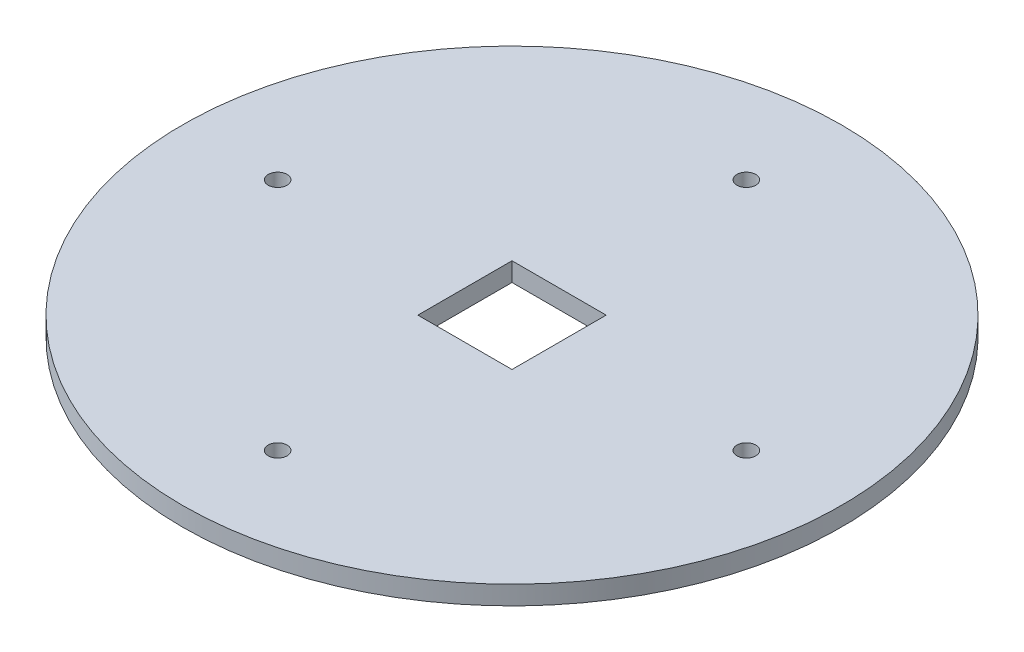
ISO-10303-21;
HEADER;
FILE_DESCRIPTION(('STEP AP214'),'2;1');
FILE_NAME('part.step','',(''),(''),'','','');
FILE_SCHEMA(('AUTOMOTIVE_DESIGN { 1 0 10303 214 1 1 1 1 }'));
ENDSEC;
DATA;
#1=APPLICATION_CONTEXT('core data for automotive mechanical design processes');
#2=APPLICATION_PROTOCOL_DEFINITION('international standard','automotive_design',2000,#1);
#3=PRODUCT_CONTEXT('',#1,'mechanical');
#4=PRODUCT('Part','Part','',(#3));
#5=PRODUCT_RELATED_PRODUCT_CATEGORY('part','',(#4));
#6=PRODUCT_DEFINITION_FORMATION('','',#4);
#7=PRODUCT_DEFINITION_CONTEXT('part definition',#1,'design');
#8=PRODUCT_DEFINITION('design','',#6,#7);
#9=PRODUCT_DEFINITION_SHAPE('','',#8);
#10=(LENGTH_UNIT() NAMED_UNIT(*) SI_UNIT(.MILLI.,.METRE.));
#11=(NAMED_UNIT(*) PLANE_ANGLE_UNIT() SI_UNIT($,.RADIAN.));
#12=(NAMED_UNIT(*) SI_UNIT($,.STERADIAN.) SOLID_ANGLE_UNIT());
#13=UNCERTAINTY_MEASURE_WITH_UNIT(LENGTH_MEASURE(1.E-05),#10,'distance_accuracy_value','');
#14=(GEOMETRIC_REPRESENTATION_CONTEXT(3) GLOBAL_UNCERTAINTY_ASSIGNED_CONTEXT((#13)) GLOBAL_UNIT_ASSIGNED_CONTEXT((#10,
#11,#12)) REPRESENTATION_CONTEXT('',''));
#15=CARTESIAN_POINT('',(0.,0.,0.));
#16=DIRECTION('',(0.,0.,1.));
#17=DIRECTION('',(1.,0.,0.));
#18=AXIS2_PLACEMENT_3D('',#15,#16,#17);
#19=CARTESIAN_POINT('',(0.,2.,0.));
#20=DIRECTION('',(0.,1.,0.));
#21=DIRECTION('',(0.,0.,1.));
#22=AXIS2_PLACEMENT_3D('',#19,#20,#21);
#23=PLANE('',#22);
#24=CARTESIAN_POINT('',(0.,2.,24.89));
#25=DIRECTION('',(0.,1.,0.));
#26=DIRECTION('',(0.,0.,1.));
#27=AXIS2_PLACEMENT_3D('',#24,#25,#26);
#28=CIRCLE('',#27,1.);
#29=CARTESIAN_POINT('',(0.,2.,25.89));
#30=VERTEX_POINT('',#29);
#31=EDGE_CURVE('E140',#30,#30,#28,.T.);
#32=ORIENTED_EDGE('',*,*,#31,.F.);
#33=EDGE_LOOP('',(#32));
#34=FACE_BOUND('',#33,.T.);
#35=DIRECTION('',(-1.,0.,0.));
#36=VECTOR('',#35,1.);
#37=CARTESIAN_POINT('',(-5.,2.,-5.));
#38=LINE('',#37,#36);
#39=CARTESIAN_POINT('',(5.,2.,-5.));
#40=VERTEX_POINT('',#39);
#41=CARTESIAN_POINT('',(-5.,2.,-5.));
#42=VERTEX_POINT('',#41);
#43=EDGE_CURVE('E82',#40,#42,#38,.T.);
#44=ORIENTED_EDGE('',*,*,#43,.F.);
#45=DIRECTION('',(0.,0.,-1.));
#46=VECTOR('',#45,1.);
#47=CARTESIAN_POINT('',(5.,2.,-5.));
#48=LINE('',#47,#46);
#49=CARTESIAN_POINT('',(5.,2.,5.));
#50=VERTEX_POINT('',#49);
#51=EDGE_CURVE('E74',#50,#40,#48,.T.);
#52=ORIENTED_EDGE('',*,*,#51,.F.);
#53=DIRECTION('',(1.,0.,0.));
#54=VECTOR('',#53,1.);
#55=CARTESIAN_POINT('',(-5.,2.,5.));
#56=LINE('',#55,#54);
#57=CARTESIAN_POINT('',(-5.,2.,5.));
#58=VERTEX_POINT('',#57);
#59=EDGE_CURVE('E97',#58,#50,#56,.T.);
#60=ORIENTED_EDGE('',*,*,#59,.F.);
#61=DIRECTION('',(0.,0.,1.));
#62=VECTOR('',#61,1.);
#63=CARTESIAN_POINT('',(-5.,2.,-5.));
#64=LINE('',#63,#62);
#65=EDGE_CURVE('E95',#42,#58,#64,.T.);
#66=ORIENTED_EDGE('',*,*,#65,.F.);
#67=EDGE_LOOP('',(#44,#52,#60,#66));
#68=FACE_BOUND('',#67,.T.);
#69=CARTESIAN_POINT('',(0.,2.,-24.89));
#70=DIRECTION('',(0.,1.,0.));
#71=DIRECTION('',(0.,0.,1.));
#72=AXIS2_PLACEMENT_3D('',#69,#70,#71);
#73=CIRCLE('',#72,1.);
#74=CARTESIAN_POINT('',(0.,2.,-23.89));
#75=VERTEX_POINT('',#74);
#76=EDGE_CURVE('E113',#75,#75,#73,.T.);
#77=ORIENTED_EDGE('',*,*,#76,.F.);
#78=EDGE_LOOP('',(#77));
#79=FACE_BOUND('',#78,.T.);
#80=CARTESIAN_POINT('',(0.,2.,0.));
#81=DIRECTION('',(0.,1.,0.));
#82=DIRECTION('',(0.,0.,1.));
#83=AXIS2_PLACEMENT_3D('',#80,#81,#82);
#84=CIRCLE('',#83,35.);
#85=CARTESIAN_POINT('',(0.,2.,35.));
#86=VERTEX_POINT('',#85);
#87=EDGE_CURVE('E11',#86,#86,#84,.T.);
#88=ORIENTED_EDGE('',*,*,#87,.T.);
#89=EDGE_LOOP('',(#88));
#90=FACE_BOUND('',#89,.T.);
#91=CARTESIAN_POINT('',(24.89,2.,0.));
#92=DIRECTION('',(0.,1.,0.));
#93=DIRECTION('',(0.,0.,1.));
#94=AXIS2_PLACEMENT_3D('',#91,#92,#93);
#95=CIRCLE('',#94,0.999999999999994);
#96=CARTESIAN_POINT('',(24.89,2.,0.999999999999992));
#97=VERTEX_POINT('',#96);
#98=EDGE_CURVE('E103',#97,#97,#95,.T.);
#99=ORIENTED_EDGE('',*,*,#98,.F.);
#100=EDGE_LOOP('',(#99));
#101=FACE_BOUND('',#100,.T.);
#102=CARTESIAN_POINT('',(-24.89,2.,0.));
#103=DIRECTION('',(0.,1.,0.));
#104=DIRECTION('',(0.,0.,1.));
#105=AXIS2_PLACEMENT_3D('',#102,#103,#104);
#106=CIRCLE('',#105,1.);
#107=CARTESIAN_POINT('',(-24.89,2.,1.00000000000001));
#108=VERTEX_POINT('',#107);
#109=EDGE_CURVE('E147',#108,#108,#106,.T.);
#110=ORIENTED_EDGE('',*,*,#109,.F.);
#111=EDGE_LOOP('',(#110));
#112=FACE_BOUND('',#111,.T.);
#113=ADVANCED_FACE('F33',(#34,#68,#79,#90,#101,#112),#23,.T.);
#114=CARTESIAN_POINT('',(0.,0.,0.));
#115=DIRECTION('',(0.,1.,0.));
#116=DIRECTION('',(0.,0.,1.));
#117=AXIS2_PLACEMENT_3D('',#114,#115,#116);
#118=PLANE('',#117);
#119=CARTESIAN_POINT('',(0.,0.,-24.89));
#120=DIRECTION('',(0.,1.,0.));
#121=DIRECTION('',(0.,0.,1.));
#122=AXIS2_PLACEMENT_3D('',#119,#120,#121);
#123=CIRCLE('',#122,1.);
#124=CARTESIAN_POINT('',(0.,0.,-23.89));
#125=VERTEX_POINT('',#124);
#126=EDGE_CURVE('E90',#125,#125,#123,.T.);
#127=ORIENTED_EDGE('',*,*,#126,.T.);
#128=EDGE_LOOP('',(#127));
#129=FACE_BOUND('',#128,.T.);
#130=CARTESIAN_POINT('',(0.,0.,0.));
#131=DIRECTION('',(0.,1.,0.));
#132=DIRECTION('',(0.,0.,1.));
#133=AXIS2_PLACEMENT_3D('',#130,#131,#132);
#134=CIRCLE('',#133,35.);
#135=CARTESIAN_POINT('',(0.,0.,35.));
#136=VERTEX_POINT('',#135);
#137=EDGE_CURVE('E37',#136,#136,#134,.T.);
#138=ORIENTED_EDGE('',*,*,#137,.F.);
#139=EDGE_LOOP('',(#138));
#140=FACE_BOUND('',#139,.T.);
#141=DIRECTION('',(0.,0.,-1.));
#142=VECTOR('',#141,1.);
#143=CARTESIAN_POINT('',(5.,0.,-5.));
#144=LINE('',#143,#142);
#145=CARTESIAN_POINT('',(5.,0.,5.));
#146=VERTEX_POINT('',#145);
#147=CARTESIAN_POINT('',(5.,0.,-5.));
#148=VERTEX_POINT('',#147);
#149=EDGE_CURVE('E56',#146,#148,#144,.T.);
#150=ORIENTED_EDGE('',*,*,#149,.T.);
#151=DIRECTION('',(-1.,0.,0.));
#152=VECTOR('',#151,1.);
#153=CARTESIAN_POINT('',(-5.,0.,-5.));
#154=LINE('',#153,#152);
#155=CARTESIAN_POINT('',(-5.,0.,-5.));
#156=VERTEX_POINT('',#155);
#157=EDGE_CURVE('E89',#148,#156,#154,.T.);
#158=ORIENTED_EDGE('',*,*,#157,.T.);
#159=DIRECTION('',(0.,0.,1.));
#160=VECTOR('',#159,1.);
#161=CARTESIAN_POINT('',(-5.,0.,-5.));
#162=LINE('',#161,#160);
#163=CARTESIAN_POINT('',(-5.,0.,5.));
#164=VERTEX_POINT('',#163);
#165=EDGE_CURVE('E105',#156,#164,#162,.T.);
#166=ORIENTED_EDGE('',*,*,#165,.T.);
#167=DIRECTION('',(1.,0.,0.));
#168=VECTOR('',#167,1.);
#169=CARTESIAN_POINT('',(-5.,0.,5.));
#170=LINE('',#169,#168);
#171=EDGE_CURVE('E83',#164,#146,#170,.T.);
#172=ORIENTED_EDGE('',*,*,#171,.T.);
#173=EDGE_LOOP('',(#150,#158,#166,#172));
#174=FACE_BOUND('',#173,.T.);
#175=CARTESIAN_POINT('',(24.89,0.,0.));
#176=DIRECTION('',(0.,1.,0.));
#177=DIRECTION('',(0.,0.,1.));
#178=AXIS2_PLACEMENT_3D('',#175,#176,#177);
#179=CIRCLE('',#178,0.999999999999994);
#180=CARTESIAN_POINT('',(24.89,0.,0.999999999999992));
#181=VERTEX_POINT('',#180);
#182=EDGE_CURVE('E142',#181,#181,#179,.T.);
#183=ORIENTED_EDGE('',*,*,#182,.T.);
#184=EDGE_LOOP('',(#183));
#185=FACE_BOUND('',#184,.T.);
#186=CARTESIAN_POINT('',(0.,0.,24.89));
#187=DIRECTION('',(0.,1.,0.));
#188=DIRECTION('',(0.,0.,1.));
#189=AXIS2_PLACEMENT_3D('',#186,#187,#188);
#190=CIRCLE('',#189,1.);
#191=CARTESIAN_POINT('',(0.,0.,25.89));
#192=VERTEX_POINT('',#191);
#193=EDGE_CURVE('E143',#192,#192,#190,.T.);
#194=ORIENTED_EDGE('',*,*,#193,.T.);
#195=EDGE_LOOP('',(#194));
#196=FACE_BOUND('',#195,.T.);
#197=CARTESIAN_POINT('',(-24.89,0.,0.));
#198=DIRECTION('',(0.,1.,0.));
#199=DIRECTION('',(0.,0.,1.));
#200=AXIS2_PLACEMENT_3D('',#197,#198,#199);
#201=CIRCLE('',#200,1.);
#202=CARTESIAN_POINT('',(-24.89,0.,1.00000000000001));
#203=VERTEX_POINT('',#202);
#204=EDGE_CURVE('E150',#203,#203,#201,.T.);
#205=ORIENTED_EDGE('',*,*,#204,.T.);
#206=EDGE_LOOP('',(#205));
#207=FACE_BOUND('',#206,.T.);
#208=ADVANCED_FACE('F119',(#129,#140,#174,#185,#196,#207),#118,.F.);
#209=CARTESIAN_POINT('',(0.,2.,0.));
#210=DIRECTION('',(0.,-1.,0.));
#211=DIRECTION('',(0.,0.,-1.));
#212=AXIS2_PLACEMENT_3D('',#209,#210,#211);
#213=CYLINDRICAL_SURFACE('',#212,35.);
#214=ORIENTED_EDGE('',*,*,#87,.F.);
#215=EDGE_LOOP('',(#214));
#216=FACE_BOUND('',#215,.T.);
#217=ORIENTED_EDGE('',*,*,#137,.T.);
#218=EDGE_LOOP('',(#217));
#219=FACE_BOUND('',#218,.T.);
#220=ADVANCED_FACE('F35',(#216,#219),#213,.T.);
#221=CARTESIAN_POINT('',(0.,2.,-24.89));
#222=DIRECTION('',(0.,-1.,0.));
#223=DIRECTION('',(0.,0.,-1.));
#224=AXIS2_PLACEMENT_3D('',#221,#222,#223);
#225=CYLINDRICAL_SURFACE('',#224,1.);
#226=ORIENTED_EDGE('',*,*,#76,.T.);
#227=EDGE_LOOP('',(#226));
#228=FACE_BOUND('',#227,.T.);
#229=ORIENTED_EDGE('',*,*,#126,.F.);
#230=EDGE_LOOP('',(#229));
#231=FACE_BOUND('',#230,.T.);
#232=ADVANCED_FACE('F122',(#228,#231),#225,.F.);
#233=CARTESIAN_POINT('',(5.,2.,-5.));
#234=DIRECTION('',(-1.,0.,0.));
#235=DIRECTION('',(0.,0.,1.));
#236=AXIS2_PLACEMENT_3D('',#233,#234,#235);
#237=PLANE('',#236);
#238=ORIENTED_EDGE('',*,*,#149,.F.);
#239=DIRECTION('',(0.,-1.,0.));
#240=VECTOR('',#239,1.);
#241=CARTESIAN_POINT('',(5.,2.,5.));
#242=LINE('',#241,#240);
#243=EDGE_CURVE('E78',#50,#146,#242,.T.);
#244=ORIENTED_EDGE('',*,*,#243,.F.);
#245=ORIENTED_EDGE('',*,*,#51,.T.);
#246=DIRECTION('',(0.,-1.,0.));
#247=VECTOR('',#246,1.);
#248=CARTESIAN_POINT('',(5.,2.,-5.));
#249=LINE('',#248,#247);
#250=EDGE_CURVE('E77',#40,#148,#249,.T.);
#251=ORIENTED_EDGE('',*,*,#250,.T.);
#252=EDGE_LOOP('',(#238,#244,#245,#251));
#253=FACE_BOUND('',#252,.T.);
#254=ADVANCED_FACE('F76',(#253),#237,.T.);
#255=CARTESIAN_POINT('',(-5.,2.,-5.));
#256=DIRECTION('',(0.,0.,1.));
#257=DIRECTION('',(1.,0.,0.));
#258=AXIS2_PLACEMENT_3D('',#255,#256,#257);
#259=PLANE('',#258);
#260=ORIENTED_EDGE('',*,*,#157,.F.);
#261=ORIENTED_EDGE('',*,*,#250,.F.);
#262=ORIENTED_EDGE('',*,*,#43,.T.);
#263=DIRECTION('',(0.,-1.,0.));
#264=VECTOR('',#263,1.);
#265=CARTESIAN_POINT('',(-5.,2.,-5.));
#266=LINE('',#265,#264);
#267=EDGE_CURVE('E91',#42,#156,#266,.T.);
#268=ORIENTED_EDGE('',*,*,#267,.T.);
#269=EDGE_LOOP('',(#260,#261,#262,#268));
#270=FACE_BOUND('',#269,.T.);
#271=ADVANCED_FACE('F86',(#270),#259,.T.);
#272=CARTESIAN_POINT('',(-5.,2.,-5.));
#273=DIRECTION('',(1.,0.,0.));
#274=DIRECTION('',(0.,0.,-1.));
#275=AXIS2_PLACEMENT_3D('',#272,#273,#274);
#276=PLANE('',#275);
#277=ORIENTED_EDGE('',*,*,#165,.F.);
#278=ORIENTED_EDGE('',*,*,#267,.F.);
#279=ORIENTED_EDGE('',*,*,#65,.T.);
#280=DIRECTION('',(0.,-1.,0.));
#281=VECTOR('',#280,1.);
#282=CARTESIAN_POINT('',(-5.,2.,5.));
#283=LINE('',#282,#281);
#284=EDGE_CURVE('E48',#58,#164,#283,.T.);
#285=ORIENTED_EDGE('',*,*,#284,.T.);
#286=EDGE_LOOP('',(#277,#278,#279,#285));
#287=FACE_BOUND('',#286,.T.);
#288=ADVANCED_FACE('F181',(#287),#276,.T.);
#289=CARTESIAN_POINT('',(-5.,2.,5.));
#290=DIRECTION('',(0.,0.,-1.));
#291=DIRECTION('',(-1.,0.,0.));
#292=AXIS2_PLACEMENT_3D('',#289,#290,#291);
#293=PLANE('',#292);
#294=ORIENTED_EDGE('',*,*,#171,.F.);
#295=ORIENTED_EDGE('',*,*,#284,.F.);
#296=ORIENTED_EDGE('',*,*,#59,.T.);
#297=ORIENTED_EDGE('',*,*,#243,.T.);
#298=EDGE_LOOP('',(#294,#295,#296,#297));
#299=FACE_BOUND('',#298,.T.);
#300=ADVANCED_FACE('F178',(#299),#293,.T.);
#301=CARTESIAN_POINT('',(24.89,2.,0.));
#302=DIRECTION('',(0.,-1.,0.));
#303=DIRECTION('',(0.,0.,-1.));
#304=AXIS2_PLACEMENT_3D('',#301,#302,#303);
#305=CYLINDRICAL_SURFACE('',#304,0.999999999999994);
#306=ORIENTED_EDGE('',*,*,#98,.T.);
#307=EDGE_LOOP('',(#306));
#308=FACE_BOUND('',#307,.T.);
#309=ORIENTED_EDGE('',*,*,#182,.F.);
#310=EDGE_LOOP('',(#309));
#311=FACE_BOUND('',#310,.T.);
#312=ADVANCED_FACE('F156',(#308,#311),#305,.F.);
#313=CARTESIAN_POINT('',(0.,2.,24.89));
#314=DIRECTION('',(0.,-1.,0.));
#315=DIRECTION('',(0.,0.,-1.));
#316=AXIS2_PLACEMENT_3D('',#313,#314,#315);
#317=CYLINDRICAL_SURFACE('',#316,1.);
#318=ORIENTED_EDGE('',*,*,#31,.T.);
#319=EDGE_LOOP('',(#318));
#320=FACE_BOUND('',#319,.T.);
#321=ORIENTED_EDGE('',*,*,#193,.F.);
#322=EDGE_LOOP('',(#321));
#323=FACE_BOUND('',#322,.T.);
#324=ADVANCED_FACE('F169',(#320,#323),#317,.F.);
#325=CARTESIAN_POINT('',(-24.89,2.,0.));
#326=DIRECTION('',(0.,-1.,0.));
#327=DIRECTION('',(0.,0.,-1.));
#328=AXIS2_PLACEMENT_3D('',#325,#326,#327);
#329=CYLINDRICAL_SURFACE('',#328,1.);
#330=ORIENTED_EDGE('',*,*,#109,.T.);
#331=EDGE_LOOP('',(#330));
#332=FACE_BOUND('',#331,.T.);
#333=ORIENTED_EDGE('',*,*,#204,.F.);
#334=EDGE_LOOP('',(#333));
#335=FACE_BOUND('',#334,.T.);
#336=ADVANCED_FACE('F167',(#332,#335),#329,.F.);
#337=CLOSED_SHELL('',(#113,#208,#220,#232,#254,#271,#288,#300,#312,#324,#336));
#338=MANIFOLD_SOLID_BREP('B2',#337);
#339=ADVANCED_BREP_SHAPE_REPRESENTATION('',(#18,#338),#14);
#340=SHAPE_DEFINITION_REPRESENTATION(#9,#339);
ENDSEC;
END-ISO-10303-21;
